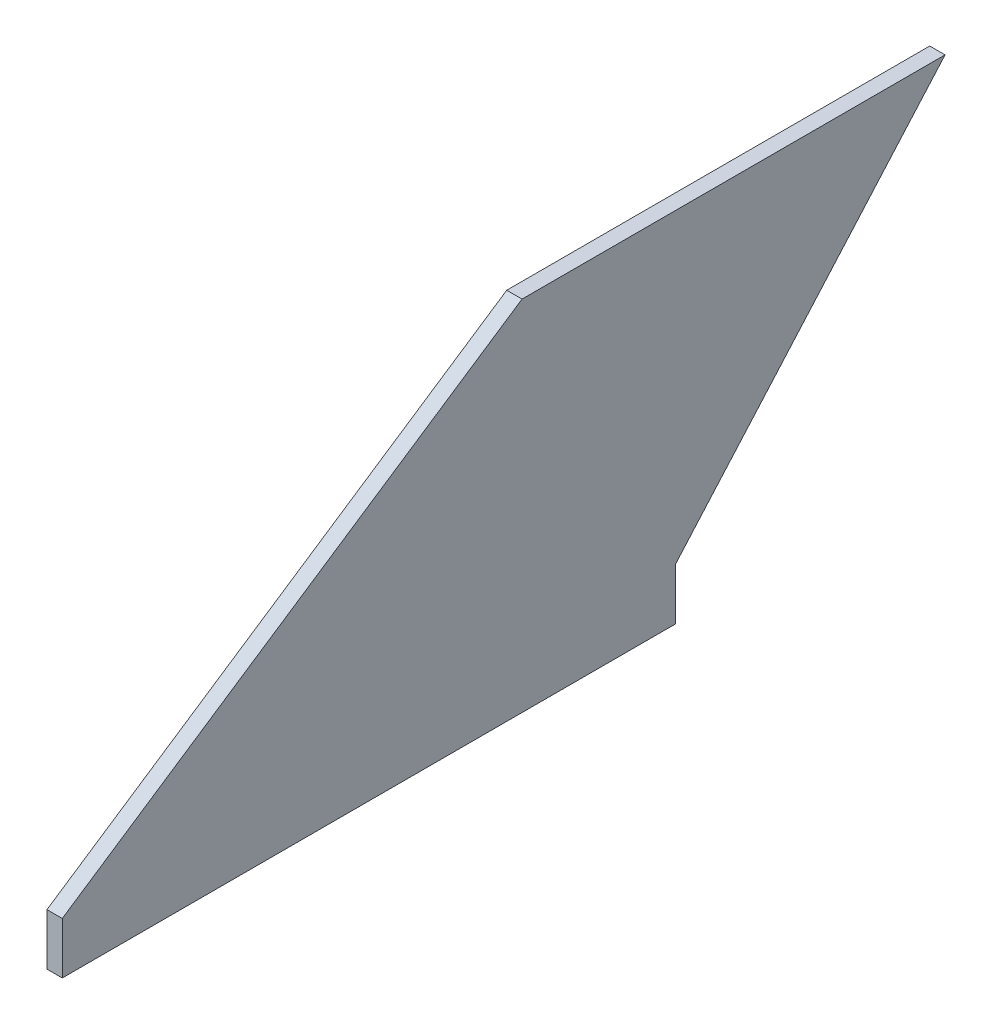
ISO-10303-21;
HEADER;
FILE_DESCRIPTION(('STEP AP214'),'2;1');
FILE_NAME('part.step','',(''),(''),'','','');
FILE_SCHEMA(('AUTOMOTIVE_DESIGN { 1 0 10303 214 1 1 1 1 }'));
ENDSEC;
DATA;
#1=APPLICATION_CONTEXT('core data for automotive mechanical design processes');
#2=APPLICATION_PROTOCOL_DEFINITION('international standard','automotive_design',2000,#1);
#3=PRODUCT_CONTEXT('',#1,'mechanical');
#4=PRODUCT('Part','Part','',(#3));
#5=PRODUCT_RELATED_PRODUCT_CATEGORY('part','',(#4));
#6=PRODUCT_DEFINITION_FORMATION('','',#4);
#7=PRODUCT_DEFINITION_CONTEXT('part definition',#1,'design');
#8=PRODUCT_DEFINITION('design','',#6,#7);
#9=PRODUCT_DEFINITION_SHAPE('','',#8);
#10=(LENGTH_UNIT() NAMED_UNIT(*) SI_UNIT(.MILLI.,.METRE.));
#11=(NAMED_UNIT(*) PLANE_ANGLE_UNIT() SI_UNIT($,.RADIAN.));
#12=(NAMED_UNIT(*) SI_UNIT($,.STERADIAN.) SOLID_ANGLE_UNIT());
#13=UNCERTAINTY_MEASURE_WITH_UNIT(LENGTH_MEASURE(1.E-05),#10,'distance_accuracy_value','');
#14=(GEOMETRIC_REPRESENTATION_CONTEXT(3) GLOBAL_UNCERTAINTY_ASSIGNED_CONTEXT((#13)) GLOBAL_UNIT_ASSIGNED_CONTEXT((#10,
#11,#12)) REPRESENTATION_CONTEXT('',''));
#15=CARTESIAN_POINT('',(0.,0.,0.));
#16=DIRECTION('',(0.,0.,1.));
#17=DIRECTION('',(1.,0.,0.));
#18=AXIS2_PLACEMENT_3D('',#15,#16,#17);
#19=CARTESIAN_POINT('',(3.175,63.5,-182.88));
#20=DIRECTION('',(0.,0.660627894892024,0.750713516922756));
#21=DIRECTION('',(0.,-0.750713516922756,0.660627894892024));
#22=AXIS2_PLACEMENT_3D('',#19,#20,#21);
#23=PLANE('',#22);
#24=DIRECTION('',(0.,0.750713516922756,-0.660627894892024));
#25=VECTOR('',#24,1.);
#26=CARTESIAN_POINT('',(0.,63.5,-182.88));
#27=LINE('',#26,#25);
#28=CARTESIAN_POINT('',(0.,0.,-127.));
#29=VERTEX_POINT('',#28);
#30=CARTESIAN_POINT('',(0.,63.5,-182.88));
#31=VERTEX_POINT('',#30);
#32=EDGE_CURVE('E123',#29,#31,#27,.T.);
#33=ORIENTED_EDGE('',*,*,#32,.T.);
#34=DIRECTION('',(-1.,0.,0.));
#35=VECTOR('',#34,1.);
#36=CARTESIAN_POINT('',(3.175,63.5,-182.88));
#37=LINE('',#36,#35);
#38=CARTESIAN_POINT('',(3.175,63.5,-182.88));
#39=VERTEX_POINT('',#38);
#40=EDGE_CURVE('E11',#39,#31,#37,.T.);
#41=ORIENTED_EDGE('',*,*,#40,.F.);
#42=DIRECTION('',(0.,0.750713516922756,-0.660627894892024));
#43=VECTOR('',#42,1.);
#44=CARTESIAN_POINT('',(3.175,63.5,-182.88));
#45=LINE('',#44,#43);
#46=CARTESIAN_POINT('',(3.175,0.,-127.));
#47=VERTEX_POINT('',#46);
#48=EDGE_CURVE('E133',#47,#39,#45,.T.);
#49=ORIENTED_EDGE('',*,*,#48,.F.);
#50=DIRECTION('',(-1.,0.,0.));
#51=VECTOR('',#50,1.);
#52=CARTESIAN_POINT('',(3.175,0.,-127.));
#53=LINE('',#52,#51);
#54=EDGE_CURVE('E119',#47,#29,#53,.T.);
#55=ORIENTED_EDGE('',*,*,#54,.T.);
#56=EDGE_LOOP('',(#33,#41,#49,#55));
#57=FACE_BOUND('',#56,.T.);
#58=ADVANCED_FACE('F39',(#57),#23,.F.);
#59=CARTESIAN_POINT('',(3.175,63.5,-95.25));
#60=DIRECTION('',(0.,-1.,0.));
#61=DIRECTION('',(0.,0.,-1.));
#62=AXIS2_PLACEMENT_3D('',#59,#60,#61);
#63=PLANE('',#62);
#64=DIRECTION('',(0.,0.,1.));
#65=VECTOR('',#64,1.);
#66=CARTESIAN_POINT('',(0.,63.5,-95.25));
#67=LINE('',#66,#65);
#68=CARTESIAN_POINT('',(0.,63.5,-95.25));
#69=VERTEX_POINT('',#68);
#70=EDGE_CURVE('E126',#31,#69,#67,.T.);
#71=ORIENTED_EDGE('',*,*,#70,.T.);
#72=DIRECTION('',(-1.,0.,0.));
#73=VECTOR('',#72,1.);
#74=CARTESIAN_POINT('',(3.175,63.5,-95.25));
#75=LINE('',#74,#73);
#76=CARTESIAN_POINT('',(3.175,63.5,-95.25));
#77=VERTEX_POINT('',#76);
#78=EDGE_CURVE('E47',#77,#69,#75,.T.);
#79=ORIENTED_EDGE('',*,*,#78,.F.);
#80=DIRECTION('',(0.,0.,1.));
#81=VECTOR('',#80,1.);
#82=CARTESIAN_POINT('',(3.175,63.5,-95.25));
#83=LINE('',#82,#81);
#84=EDGE_CURVE('E92',#39,#77,#83,.T.);
#85=ORIENTED_EDGE('',*,*,#84,.F.);
#86=ORIENTED_EDGE('',*,*,#40,.T.);
#87=EDGE_LOOP('',(#71,#79,#85,#86));
#88=FACE_BOUND('',#87,.T.);
#89=ADVANCED_FACE('F157',(#88),#63,.F.);
#90=CARTESIAN_POINT('',(3.175,0.,0.));
#91=DIRECTION('',(0.,-0.832050294337844,-0.554700196225229));
#92=DIRECTION('',(0.,0.554700196225229,-0.832050294337844));
#93=AXIS2_PLACEMENT_3D('',#90,#91,#92);
#94=PLANE('',#93);
#95=DIRECTION('',(0.,-0.554700196225229,0.832050294337844));
#96=VECTOR('',#95,1.);
#97=CARTESIAN_POINT('',(0.,0.,0.));
#98=LINE('',#97,#96);
#99=CARTESIAN_POINT('',(0.,0.,0.));
#100=VERTEX_POINT('',#99);
#101=EDGE_CURVE('E128',#69,#100,#98,.T.);
#102=ORIENTED_EDGE('',*,*,#101,.T.);
#103=DIRECTION('',(-1.,0.,0.));
#104=VECTOR('',#103,1.);
#105=CARTESIAN_POINT('',(3.175,0.,0.));
#106=LINE('',#105,#104);
#107=CARTESIAN_POINT('',(3.175,0.,0.));
#108=VERTEX_POINT('',#107);
#109=EDGE_CURVE('E114',#108,#100,#106,.T.);
#110=ORIENTED_EDGE('',*,*,#109,.F.);
#111=DIRECTION('',(0.,-0.554700196225229,0.832050294337844));
#112=VECTOR('',#111,1.);
#113=CARTESIAN_POINT('',(3.175,0.,0.));
#114=LINE('',#113,#112);
#115=EDGE_CURVE('E105',#77,#108,#114,.T.);
#116=ORIENTED_EDGE('',*,*,#115,.F.);
#117=ORIENTED_EDGE('',*,*,#78,.T.);
#118=EDGE_LOOP('',(#102,#110,#116,#117));
#119=FACE_BOUND('',#118,.T.);
#120=ADVANCED_FACE('F139',(#119),#94,.F.);
#121=CARTESIAN_POINT('',(3.175,-10.6807,0.));
#122=DIRECTION('',(0.,0.,-1.));
#123=DIRECTION('',(-1.,0.,0.));
#124=AXIS2_PLACEMENT_3D('',#121,#122,#123);
#125=PLANE('',#124);
#126=DIRECTION('',(0.,-1.,0.));
#127=VECTOR('',#126,1.);
#128=CARTESIAN_POINT('',(0.,-10.6807,0.));
#129=LINE('',#128,#127);
#130=CARTESIAN_POINT('',(0.,-10.6807,0.));
#131=VERTEX_POINT('',#130);
#132=EDGE_CURVE('E113',#100,#131,#129,.T.);
#133=ORIENTED_EDGE('',*,*,#132,.T.);
#134=DIRECTION('',(-1.,0.,0.));
#135=VECTOR('',#134,1.);
#136=CARTESIAN_POINT('',(3.175,-10.6807,0.));
#137=LINE('',#136,#135);
#138=CARTESIAN_POINT('',(3.175,-10.6807,0.));
#139=VERTEX_POINT('',#138);
#140=EDGE_CURVE('E110',#139,#131,#137,.T.);
#141=ORIENTED_EDGE('',*,*,#140,.F.);
#142=DIRECTION('',(0.,-1.,0.));
#143=VECTOR('',#142,1.);
#144=CARTESIAN_POINT('',(3.175,-10.6807,0.));
#145=LINE('',#144,#143);
#146=EDGE_CURVE('E99',#108,#139,#145,.T.);
#147=ORIENTED_EDGE('',*,*,#146,.F.);
#148=ORIENTED_EDGE('',*,*,#109,.T.);
#149=EDGE_LOOP('',(#133,#141,#147,#148));
#150=FACE_BOUND('',#149,.T.);
#151=ADVANCED_FACE('F111',(#150),#125,.F.);
#152=CARTESIAN_POINT('',(3.175,-10.6807,0.));
#153=DIRECTION('',(0.,1.,0.));
#154=DIRECTION('',(0.,0.,1.));
#155=AXIS2_PLACEMENT_3D('',#152,#153,#154);
#156=PLANE('',#155);
#157=DIRECTION('',(0.,0.,-1.));
#158=VECTOR('',#157,1.);
#159=CARTESIAN_POINT('',(0.,-10.6807,0.));
#160=LINE('',#159,#158);
#161=CARTESIAN_POINT('',(0.,-10.6807,-127.));
#162=VERTEX_POINT('',#161);
#163=EDGE_CURVE('E78',#131,#162,#160,.T.);
#164=ORIENTED_EDGE('',*,*,#163,.T.);
#165=DIRECTION('',(-1.,0.,0.));
#166=VECTOR('',#165,1.);
#167=CARTESIAN_POINT('',(3.175,-10.6807,-127.));
#168=LINE('',#167,#166);
#169=CARTESIAN_POINT('',(3.175,-10.6807,-127.));
#170=VERTEX_POINT('',#169);
#171=EDGE_CURVE('E115',#170,#162,#168,.T.);
#172=ORIENTED_EDGE('',*,*,#171,.F.);
#173=DIRECTION('',(0.,0.,-1.));
#174=VECTOR('',#173,1.);
#175=CARTESIAN_POINT('',(3.175,-10.6807,0.));
#176=LINE('',#175,#174);
#177=EDGE_CURVE('E103',#139,#170,#176,.T.);
#178=ORIENTED_EDGE('',*,*,#177,.F.);
#179=ORIENTED_EDGE('',*,*,#140,.T.);
#180=EDGE_LOOP('',(#164,#172,#178,#179));
#181=FACE_BOUND('',#180,.T.);
#182=ADVANCED_FACE('F117',(#181),#156,.F.);
#183=CARTESIAN_POINT('',(3.175,-10.6807,-127.));
#184=DIRECTION('',(0.,0.,1.));
#185=DIRECTION('',(1.,0.,0.));
#186=AXIS2_PLACEMENT_3D('',#183,#184,#185);
#187=PLANE('',#186);
#188=DIRECTION('',(0.,1.,0.));
#189=VECTOR('',#188,1.);
#190=CARTESIAN_POINT('',(0.,-10.6807,-127.));
#191=LINE('',#190,#189);
#192=EDGE_CURVE('E84',#162,#29,#191,.T.);
#193=ORIENTED_EDGE('',*,*,#192,.T.);
#194=ORIENTED_EDGE('',*,*,#54,.F.);
#195=DIRECTION('',(0.,1.,0.));
#196=VECTOR('',#195,1.);
#197=CARTESIAN_POINT('',(3.175,-10.6807,-127.));
#198=LINE('',#197,#196);
#199=EDGE_CURVE('E55',#170,#47,#198,.T.);
#200=ORIENTED_EDGE('',*,*,#199,.F.);
#201=ORIENTED_EDGE('',*,*,#171,.T.);
#202=EDGE_LOOP('',(#193,#194,#200,#201));
#203=FACE_BOUND('',#202,.T.);
#204=ADVANCED_FACE('F146',(#203),#187,.F.);
#205=CARTESIAN_POINT('',(3.175,0.,0.));
#206=DIRECTION('',(1.,0.,0.));
#207=DIRECTION('',(0.,0.,-1.));
#208=AXIS2_PLACEMENT_3D('',#205,#206,#207);
#209=PLANE('',#208);
#210=ORIENTED_EDGE('',*,*,#48,.T.);
#211=ORIENTED_EDGE('',*,*,#84,.T.);
#212=ORIENTED_EDGE('',*,*,#115,.T.);
#213=ORIENTED_EDGE('',*,*,#146,.T.);
#214=ORIENTED_EDGE('',*,*,#177,.T.);
#215=ORIENTED_EDGE('',*,*,#199,.T.);
#216=EDGE_LOOP('',(#210,#211,#212,#213,#214,#215));
#217=FACE_BOUND('',#216,.T.);
#218=ADVANCED_FACE('F101',(#217),#209,.T.);
#219=CARTESIAN_POINT('',(0.,0.,0.));
#220=DIRECTION('',(1.,0.,0.));
#221=DIRECTION('',(0.,0.,-1.));
#222=AXIS2_PLACEMENT_3D('',#219,#220,#221);
#223=PLANE('',#222);
#224=ORIENTED_EDGE('',*,*,#32,.F.);
#225=ORIENTED_EDGE('',*,*,#192,.F.);
#226=ORIENTED_EDGE('',*,*,#163,.F.);
#227=ORIENTED_EDGE('',*,*,#132,.F.);
#228=ORIENTED_EDGE('',*,*,#101,.F.);
#229=ORIENTED_EDGE('',*,*,#70,.F.);
#230=EDGE_LOOP('',(#224,#225,#226,#227,#228,#229));
#231=FACE_BOUND('',#230,.T.);
#232=ADVANCED_FACE('F142',(#231),#223,.F.);
#233=CLOSED_SHELL('',(#58,#89,#120,#151,#182,#204,#218,#232));
#234=MANIFOLD_SOLID_BREP('B2',#233);
#235=ADVANCED_BREP_SHAPE_REPRESENTATION('',(#18,#234),#14);
#236=SHAPE_DEFINITION_REPRESENTATION(#9,#235);
ENDSEC;
END-ISO-10303-21;
